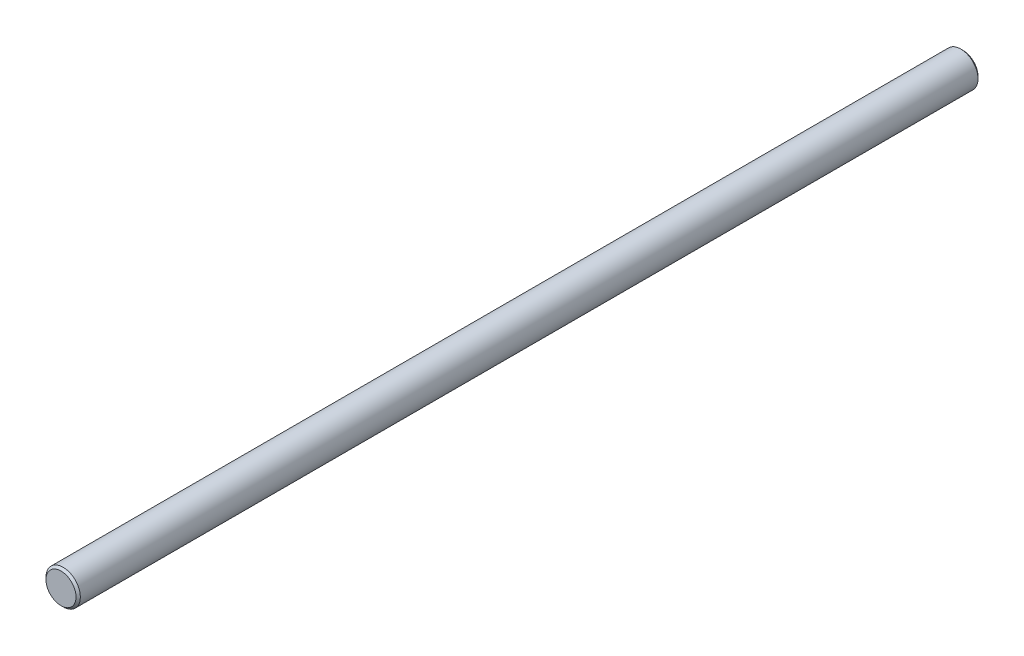
ISO-10303-21;
HEADER;
FILE_DESCRIPTION(('STEP AP214'),'2;1');
FILE_NAME('part.step','',(''),(''),'','','');
FILE_SCHEMA(('AUTOMOTIVE_DESIGN { 1 0 10303 214 1 1 1 1 }'));
ENDSEC;
DATA;
#1=APPLICATION_CONTEXT('core data for automotive mechanical design processes');
#2=APPLICATION_PROTOCOL_DEFINITION('international standard','automotive_design',2000,#1);
#3=PRODUCT_CONTEXT('',#1,'mechanical');
#4=PRODUCT('Part','Part','',(#3));
#5=PRODUCT_RELATED_PRODUCT_CATEGORY('part','',(#4));
#6=PRODUCT_DEFINITION_FORMATION('','',#4);
#7=PRODUCT_DEFINITION_CONTEXT('part definition',#1,'design');
#8=PRODUCT_DEFINITION('design','',#6,#7);
#9=PRODUCT_DEFINITION_SHAPE('','',#8);
#10=(LENGTH_UNIT() NAMED_UNIT(*) SI_UNIT(.MILLI.,.METRE.));
#11=(NAMED_UNIT(*) PLANE_ANGLE_UNIT() SI_UNIT($,.RADIAN.));
#12=(NAMED_UNIT(*) SI_UNIT($,.STERADIAN.) SOLID_ANGLE_UNIT());
#13=UNCERTAINTY_MEASURE_WITH_UNIT(LENGTH_MEASURE(1.E-05),#10,'distance_accuracy_value','');
#14=(GEOMETRIC_REPRESENTATION_CONTEXT(3) GLOBAL_UNCERTAINTY_ASSIGNED_CONTEXT((#13)) GLOBAL_UNIT_ASSIGNED_CONTEXT((#10,
#11,#12)) REPRESENTATION_CONTEXT('',''));
#15=CARTESIAN_POINT('',(0.,0.,0.));
#16=DIRECTION('',(0.,0.,1.));
#17=DIRECTION('',(1.,0.,0.));
#18=AXIS2_PLACEMENT_3D('',#15,#16,#17);
#19=CARTESIAN_POINT('',(0.,0.,-210.));
#20=DIRECTION('',(0.,0.,1.));
#21=DIRECTION('',(1.,0.,0.));
#22=AXIS2_PLACEMENT_3D('',#19,#20,#21);
#23=CYLINDRICAL_SURFACE('',#22,4.);
#24=CARTESIAN_POINT('',(0.,0.,-209.5));
#25=DIRECTION('',(0.,0.,1.));
#26=DIRECTION('',(1.,0.,0.));
#27=AXIS2_PLACEMENT_3D('',#24,#25,#26);
#28=CIRCLE('',#27,4.);
#29=CARTESIAN_POINT('',(4.,0.,-209.5));
#30=VERTEX_POINT('',#29);
#31=EDGE_CURVE('E46',#30,#30,#28,.T.);
#32=ORIENTED_EDGE('',*,*,#31,.T.);
#33=EDGE_LOOP('',(#32));
#34=FACE_BOUND('',#33,.T.);
#35=CARTESIAN_POINT('',(0.,0.,-0.499999999999973));
#36=DIRECTION('',(0.,0.,1.));
#37=DIRECTION('',(1.,0.,0.));
#38=AXIS2_PLACEMENT_3D('',#35,#36,#37);
#39=CIRCLE('',#38,4.);
#40=CARTESIAN_POINT('',(4.,0.,-0.499999999999973));
#41=VERTEX_POINT('',#40);
#42=EDGE_CURVE('E50',#41,#41,#39,.F.);
#43=ORIENTED_EDGE('',*,*,#42,.T.);
#44=EDGE_LOOP('',(#43));
#45=FACE_BOUND('',#44,.T.);
#46=ADVANCED_FACE('F35',(#34,#45),#23,.T.);
#47=CARTESIAN_POINT('',(0.,0.,-210.));
#48=DIRECTION('',(0.,0.,1.));
#49=DIRECTION('',(1.,0.,0.));
#50=AXIS2_PLACEMENT_3D('',#47,#48,#49);
#51=PLANE('',#50);
#52=CARTESIAN_POINT('',(0.,0.,-210.));
#53=DIRECTION('',(0.,0.,1.));
#54=DIRECTION('',(1.,0.,0.));
#55=AXIS2_PLACEMENT_3D('',#52,#53,#54);
#56=CIRCLE('',#55,3.5);
#57=CARTESIAN_POINT('',(3.5,0.,-210.));
#58=VERTEX_POINT('',#57);
#59=EDGE_CURVE('E42',#58,#58,#56,.F.);
#60=ORIENTED_EDGE('',*,*,#59,.T.);
#61=EDGE_LOOP('',(#60));
#62=FACE_BOUND('',#61,.T.);
#63=ADVANCED_FACE('F66',(#62),#51,.F.);
#64=CARTESIAN_POINT('',(0.,0.,0.));
#65=DIRECTION('',(0.,0.,1.));
#66=DIRECTION('',(1.,0.,0.));
#67=AXIS2_PLACEMENT_3D('',#64,#65,#66);
#68=PLANE('',#67);
#69=CARTESIAN_POINT('',(0.,0.,0.));
#70=DIRECTION('',(0.,0.,1.));
#71=DIRECTION('',(1.,0.,0.));
#72=AXIS2_PLACEMENT_3D('',#69,#70,#71);
#73=CIRCLE('',#72,3.5);
#74=CARTESIAN_POINT('',(3.5,0.,0.));
#75=VERTEX_POINT('',#74);
#76=EDGE_CURVE('E10',#75,#75,#73,.T.);
#77=ORIENTED_EDGE('',*,*,#76,.T.);
#78=EDGE_LOOP('',(#77));
#79=FACE_BOUND('',#78,.T.);
#80=ADVANCED_FACE('F63',(#79),#68,.T.);
#81=CARTESIAN_POINT('',(0.,0.,-209.5));
#82=DIRECTION('',(0.,0.,1.));
#83=DIRECTION('',(1.,0.,0.));
#84=AXIS2_PLACEMENT_3D('',#81,#82,#83);
#85=CONICAL_SURFACE('',#84,4.,0.785398163397445);
#86=ORIENTED_EDGE('',*,*,#59,.F.);
#87=EDGE_LOOP('',(#86));
#88=FACE_BOUND('',#87,.T.);
#89=ORIENTED_EDGE('',*,*,#31,.F.);
#90=EDGE_LOOP('',(#89));
#91=FACE_BOUND('',#90,.T.);
#92=ADVANCED_FACE('F59',(#88,#91),#85,.T.);
#93=CARTESIAN_POINT('',(0.,0.,0.));
#94=DIRECTION('',(0.,0.,-1.));
#95=DIRECTION('',(-1.,0.,0.));
#96=AXIS2_PLACEMENT_3D('',#93,#94,#95);
#97=CONICAL_SURFACE('',#96,3.5,0.785398163397473);
#98=ORIENTED_EDGE('',*,*,#42,.F.);
#99=EDGE_LOOP('',(#98));
#100=FACE_BOUND('',#99,.T.);
#101=ORIENTED_EDGE('',*,*,#76,.F.);
#102=EDGE_LOOP('',(#101));
#103=FACE_BOUND('',#102,.T.);
#104=ADVANCED_FACE('F37',(#100,#103),#97,.T.);
#105=CLOSED_SHELL('',(#46,#63,#80,#92,#104));
#106=MANIFOLD_SOLID_BREP('B2',#105);
#107=ADVANCED_BREP_SHAPE_REPRESENTATION('',(#18,#106),#14);
#108=SHAPE_DEFINITION_REPRESENTATION(#9,#107);
ENDSEC;
END-ISO-10303-21;
